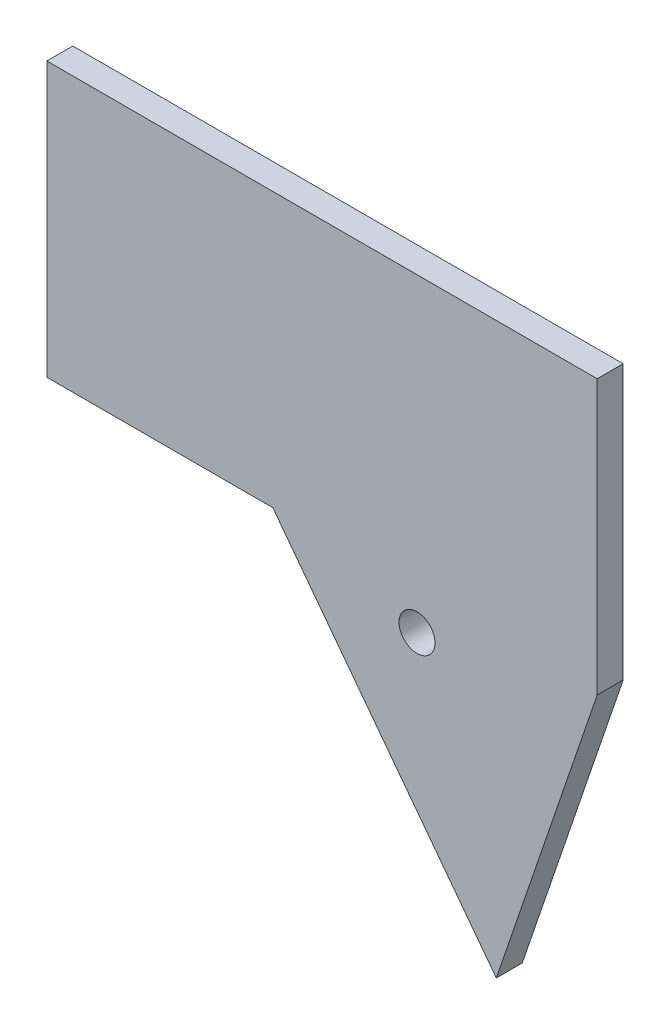
ISO-10303-21;
HEADER;
FILE_DESCRIPTION(('STEP AP214'),'2;1');
FILE_NAME('part.step','',(''),(''),'','','');
FILE_SCHEMA(('AUTOMOTIVE_DESIGN { 1 0 10303 214 1 1 1 1 }'));
ENDSEC;
DATA;
#1=APPLICATION_CONTEXT('core data for automotive mechanical design processes');
#2=APPLICATION_PROTOCOL_DEFINITION('international standard','automotive_design',2000,#1);
#3=PRODUCT_CONTEXT('',#1,'mechanical');
#4=PRODUCT('Part','Part','',(#3));
#5=PRODUCT_RELATED_PRODUCT_CATEGORY('part','',(#4));
#6=PRODUCT_DEFINITION_FORMATION('','',#4);
#7=PRODUCT_DEFINITION_CONTEXT('part definition',#1,'design');
#8=PRODUCT_DEFINITION('design','',#6,#7);
#9=PRODUCT_DEFINITION_SHAPE('','',#8);
#10=(LENGTH_UNIT() NAMED_UNIT(*) SI_UNIT(.MILLI.,.METRE.));
#11=(NAMED_UNIT(*) PLANE_ANGLE_UNIT() SI_UNIT($,.RADIAN.));
#12=(NAMED_UNIT(*) SI_UNIT($,.STERADIAN.) SOLID_ANGLE_UNIT());
#13=UNCERTAINTY_MEASURE_WITH_UNIT(LENGTH_MEASURE(1.E-05),#10,'distance_accuracy_value','');
#14=(GEOMETRIC_REPRESENTATION_CONTEXT(3) GLOBAL_UNCERTAINTY_ASSIGNED_CONTEXT((#13)) GLOBAL_UNIT_ASSIGNED_CONTEXT((#10,
#11,#12)) REPRESENTATION_CONTEXT('',''));
#15=CARTESIAN_POINT('',(0.,0.,0.));
#16=DIRECTION('',(0.,0.,1.));
#17=DIRECTION('',(1.,0.,0.));
#18=AXIS2_PLACEMENT_3D('',#15,#16,#17);
#19=CARTESIAN_POINT('',(-16.,-19.,3.));
#20=DIRECTION('',(0.,1.,0.));
#21=DIRECTION('',(0.,0.,1.));
#22=AXIS2_PLACEMENT_3D('',#19,#20,#21);
#23=PLANE('',#22);
#24=DIRECTION('',(0.,0.,-1.));
#25=VECTOR('',#24,1.);
#26=CARTESIAN_POINT('',(15.3546368688924,-19.,64.4769250208977));
#27=LINE('',#26,#25);
#28=CARTESIAN_POINT('',(15.3546368688924,-19.,3.6));
#29=VERTEX_POINT('',#28);
#30=CARTESIAN_POINT('',(15.3546368688924,-19.,0.));
#31=VERTEX_POINT('',#30);
#32=EDGE_CURVE('E59',#29,#31,#27,.T.);
#33=ORIENTED_EDGE('',*,*,#32,.F.);
#34=DIRECTION('',(-1.,0.,0.));
#35=VECTOR('',#34,1.);
#36=CARTESIAN_POINT('',(60.3546368688924,-19.,3.6));
#37=LINE('',#36,#35);
#38=CARTESIAN_POINT('',(-16.,-19.,3.6));
#39=VERTEX_POINT('',#38);
#40=EDGE_CURVE('E139',#29,#39,#37,.T.);
#41=ORIENTED_EDGE('',*,*,#40,.T.);
#42=DIRECTION('',(0.,0.,-1.));
#43=VECTOR('',#42,1.);
#44=CARTESIAN_POINT('',(-16.,-19.,3.));
#45=LINE('',#44,#43);
#46=CARTESIAN_POINT('',(-16.,-19.,0.));
#47=VERTEX_POINT('',#46);
#48=EDGE_CURVE('E11',#39,#47,#45,.T.);
#49=ORIENTED_EDGE('',*,*,#48,.T.);
#50=DIRECTION('',(1.,0.,0.));
#51=VECTOR('',#50,1.);
#52=CARTESIAN_POINT('',(-16.,-19.,0.));
#53=LINE('',#52,#51);
#54=EDGE_CURVE('E168',#47,#31,#53,.T.);
#55=ORIENTED_EDGE('',*,*,#54,.T.);
#56=EDGE_LOOP('',(#33,#41,#49,#55));
#57=FACE_BOUND('',#56,.T.);
#58=ADVANCED_FACE('F43',(#57),#23,.F.);
#59=CARTESIAN_POINT('',(0.,0.,0.));
#60=DIRECTION('',(0.,0.,1.));
#61=DIRECTION('',(1.,0.,0.));
#62=AXIS2_PLACEMENT_3D('',#59,#60,#61);
#63=PLANE('',#62);
#64=DIRECTION('',(0.,-1.,0.));
#65=VECTOR('',#64,1.);
#66=CARTESIAN_POINT('',(-16.,19.,0.));
#67=LINE('',#66,#65);
#68=CARTESIAN_POINT('',(-16.,19.,0.));
#69=VERTEX_POINT('',#68);
#70=EDGE_CURVE('E164',#69,#47,#67,.T.);
#71=ORIENTED_EDGE('',*,*,#70,.F.);
#72=DIRECTION('',(-1.,0.,0.));
#73=VECTOR('',#72,1.);
#74=CARTESIAN_POINT('',(-16.,19.,0.));
#75=LINE('',#74,#73);
#76=CARTESIAN_POINT('',(60.3546368688924,19.,0.));
#77=VERTEX_POINT('',#76);
#78=EDGE_CURVE('E67',#77,#69,#75,.T.);
#79=ORIENTED_EDGE('',*,*,#78,.F.);
#80=DIRECTION('',(0.,1.,0.));
#81=VECTOR('',#80,1.);
#82=CARTESIAN_POINT('',(60.3546368688924,19.,0.));
#83=LINE('',#82,#81);
#84=CARTESIAN_POINT('',(60.3546368688924,-19.,0.));
#85=VERTEX_POINT('',#84);
#86=EDGE_CURVE('E118',#85,#77,#83,.T.);
#87=ORIENTED_EDGE('',*,*,#86,.F.);
#88=DIRECTION('',(-0.32314385329151,-0.946349856067995,0.));
#89=VECTOR('',#88,1.);
#90=CARTESIAN_POINT('',(46.3546368688924,-60.,0.));
#91=LINE('',#90,#89);
#92=CARTESIAN_POINT('',(46.3546368688924,-60.,0.));
#93=VERTEX_POINT('',#92);
#94=EDGE_CURVE('E103',#85,#93,#91,.T.);
#95=ORIENTED_EDGE('',*,*,#94,.T.);
#96=DIRECTION('',(-0.603108274871746,0.797659331281987,0.));
#97=VECTOR('',#96,1.);
#98=CARTESIAN_POINT('',(15.3546368688924,-19.,0.));
#99=LINE('',#98,#97);
#100=EDGE_CURVE('E110',#93,#31,#99,.T.);
#101=ORIENTED_EDGE('',*,*,#100,.T.);
#102=ORIENTED_EDGE('',*,*,#54,.F.);
#103=EDGE_LOOP('',(#71,#79,#87,#95,#101,#102));
#104=FACE_BOUND('',#103,.T.);
#105=CARTESIAN_POINT('',(0.,0.,0.));
#106=DIRECTION('',(0.,0.,1.));
#107=DIRECTION('',(1.,0.,0.));
#108=AXIS2_PLACEMENT_3D('',#105,#106,#107);
#109=CIRCLE('',#108,4.55);
#110=CARTESIAN_POINT('',(4.55,0.,0.));
#111=VERTEX_POINT('',#110);
#112=EDGE_CURVE('E160',#111,#111,#109,.T.);
#113=ORIENTED_EDGE('',*,*,#112,.T.);
#114=EDGE_LOOP('',(#113));
#115=FACE_BOUND('',#114,.T.);
#116=CARTESIAN_POINT('',(35.3546368688924,-24.,0.));
#117=DIRECTION('',(0.,0.,-1.));
#118=DIRECTION('',(-1.,0.,0.));
#119=AXIS2_PLACEMENT_3D('',#116,#117,#118);
#120=CIRCLE('',#119,2.49999999999999);
#121=CARTESIAN_POINT('',(32.8546368688924,-24.,0.));
#122=VERTEX_POINT('',#121);
#123=EDGE_CURVE('E120',#122,#122,#120,.T.);
#124=ORIENTED_EDGE('',*,*,#123,.F.);
#125=EDGE_LOOP('',(#124));
#126=FACE_BOUND('',#125,.T.);
#127=ADVANCED_FACE('F116',(#104,#115,#126),#63,.F.);
#128=CARTESIAN_POINT('',(-16.,19.,3.));
#129=DIRECTION('',(1.,0.,0.));
#130=DIRECTION('',(0.,0.,-1.));
#131=AXIS2_PLACEMENT_3D('',#128,#129,#130);
#132=PLANE('',#131);
#133=ORIENTED_EDGE('',*,*,#70,.T.);
#134=ORIENTED_EDGE('',*,*,#48,.F.);
#135=DIRECTION('',(0.,1.,0.));
#136=VECTOR('',#135,1.);
#137=CARTESIAN_POINT('',(-16.,-19.,3.6));
#138=LINE('',#137,#136);
#139=CARTESIAN_POINT('',(-16.,19.,3.6));
#140=VERTEX_POINT('',#139);
#141=EDGE_CURVE('E145',#39,#140,#138,.T.);
#142=ORIENTED_EDGE('',*,*,#141,.T.);
#143=DIRECTION('',(0.,0.,-1.));
#144=VECTOR('',#143,1.);
#145=CARTESIAN_POINT('',(-16.,19.,3.));
#146=LINE('',#145,#144);
#147=EDGE_CURVE('E175',#140,#69,#146,.T.);
#148=ORIENTED_EDGE('',*,*,#147,.T.);
#149=EDGE_LOOP('',(#133,#134,#142,#148));
#150=FACE_BOUND('',#149,.T.);
#151=ADVANCED_FACE('F45',(#150),#132,.F.);
#152=CARTESIAN_POINT('',(60.3546368688924,19.,3.));
#153=DIRECTION('',(-1.,0.,0.));
#154=DIRECTION('',(0.,0.,1.));
#155=AXIS2_PLACEMENT_3D('',#152,#153,#154);
#156=PLANE('',#155);
#157=ORIENTED_EDGE('',*,*,#86,.T.);
#158=DIRECTION('',(0.,0.,-1.));
#159=VECTOR('',#158,1.);
#160=CARTESIAN_POINT('',(60.3546368688924,19.,3.));
#161=LINE('',#160,#159);
#162=CARTESIAN_POINT('',(60.3546368688924,19.,3.6));
#163=VERTEX_POINT('',#162);
#164=EDGE_CURVE('E178',#163,#77,#161,.T.);
#165=ORIENTED_EDGE('',*,*,#164,.F.);
#166=DIRECTION('',(0.,-1.,0.));
#167=VECTOR('',#166,1.);
#168=CARTESIAN_POINT('',(60.3546368688924,19.,3.6));
#169=LINE('',#168,#167);
#170=CARTESIAN_POINT('',(60.3546368688924,-19.,3.6));
#171=VERTEX_POINT('',#170);
#172=EDGE_CURVE('E153',#163,#171,#169,.T.);
#173=ORIENTED_EDGE('',*,*,#172,.T.);
#174=DIRECTION('',(0.,0.,-1.));
#175=VECTOR('',#174,1.);
#176=CARTESIAN_POINT('',(60.3546368688924,-19.,3.));
#177=LINE('',#176,#175);
#178=EDGE_CURVE('E52',#171,#85,#177,.T.);
#179=ORIENTED_EDGE('',*,*,#178,.T.);
#180=EDGE_LOOP('',(#157,#165,#173,#179));
#181=FACE_BOUND('',#180,.T.);
#182=ADVANCED_FACE('F182',(#181),#156,.F.);
#183=CARTESIAN_POINT('',(-16.,19.,3.));
#184=DIRECTION('',(0.,-1.,0.));
#185=DIRECTION('',(0.,0.,-1.));
#186=AXIS2_PLACEMENT_3D('',#183,#184,#185);
#187=PLANE('',#186);
#188=ORIENTED_EDGE('',*,*,#78,.T.);
#189=ORIENTED_EDGE('',*,*,#147,.F.);
#190=DIRECTION('',(1.,0.,0.));
#191=VECTOR('',#190,1.);
#192=CARTESIAN_POINT('',(-16.,19.,3.6));
#193=LINE('',#192,#191);
#194=EDGE_CURVE('E149',#140,#163,#193,.T.);
#195=ORIENTED_EDGE('',*,*,#194,.T.);
#196=ORIENTED_EDGE('',*,*,#164,.T.);
#197=EDGE_LOOP('',(#188,#189,#195,#196));
#198=FACE_BOUND('',#197,.T.);
#199=ADVANCED_FACE('F209',(#198),#187,.F.);
#200=CARTESIAN_POINT('',(0.,0.,3.));
#201=DIRECTION('',(0.,0.,-1.));
#202=DIRECTION('',(-1.,0.,0.));
#203=AXIS2_PLACEMENT_3D('',#200,#201,#202);
#204=CYLINDRICAL_SURFACE('',#203,4.55);
#205=CARTESIAN_POINT('',(0.,0.,3.));
#206=DIRECTION('',(0.,0.,1.));
#207=DIRECTION('',(1.,0.,0.));
#208=AXIS2_PLACEMENT_3D('',#205,#206,#207);
#209=CIRCLE('',#208,4.55);
#210=CARTESIAN_POINT('',(4.55,0.,3.));
#211=VERTEX_POINT('',#210);
#212=EDGE_CURVE('E156',#211,#211,#209,.T.);
#213=ORIENTED_EDGE('',*,*,#212,.T.);
#214=EDGE_LOOP('',(#213));
#215=FACE_BOUND('',#214,.T.);
#216=ORIENTED_EDGE('',*,*,#112,.F.);
#217=EDGE_LOOP('',(#216));
#218=FACE_BOUND('',#217,.T.);
#219=ADVANCED_FACE('F207',(#215,#218),#204,.F.);
#220=CARTESIAN_POINT('',(0.,0.,3.));
#221=DIRECTION('',(0.,0.,-1.));
#222=DIRECTION('',(-1.,0.,0.));
#223=AXIS2_PLACEMENT_3D('',#220,#221,#222);
#224=PLANE('',#223);
#225=CARTESIAN_POINT('',(0.,0.,3.));
#226=DIRECTION('',(0.,0.,-1.));
#227=DIRECTION('',(-1.,0.,0.));
#228=AXIS2_PLACEMENT_3D('',#225,#226,#227);
#229=CIRCLE('',#228,3.5);
#230=CARTESIAN_POINT('',(-3.5,0.,3.));
#231=VERTEX_POINT('',#230);
#232=EDGE_CURVE('E134',#231,#231,#229,.T.);
#233=ORIENTED_EDGE('',*,*,#232,.F.);
#234=EDGE_LOOP('',(#233));
#235=FACE_BOUND('',#234,.T.);
#236=ORIENTED_EDGE('',*,*,#212,.F.);
#237=EDGE_LOOP('',(#236));
#238=FACE_BOUND('',#237,.T.);
#239=ADVANCED_FACE('F229',(#235,#238),#224,.T.);
#240=CARTESIAN_POINT('',(0.,0.,3.6));
#241=DIRECTION('',(0.,0.,-1.));
#242=DIRECTION('',(-1.,0.,0.));
#243=AXIS2_PLACEMENT_3D('',#240,#241,#242);
#244=PLANE('',#243);
#245=ORIENTED_EDGE('',*,*,#40,.F.);
#246=DIRECTION('',(0.603108274871746,-0.797659331281987,0.));
#247=VECTOR('',#246,1.);
#248=CARTESIAN_POINT('',(15.3546368688924,-19.,3.6));
#249=LINE('',#248,#247);
#250=CARTESIAN_POINT('',(46.3546368688924,-60.,3.6));
#251=VERTEX_POINT('',#250);
#252=EDGE_CURVE('E128',#29,#251,#249,.T.);
#253=ORIENTED_EDGE('',*,*,#252,.T.);
#254=DIRECTION('',(0.32314385329151,0.946349856067995,0.));
#255=VECTOR('',#254,1.);
#256=CARTESIAN_POINT('',(46.3546368688924,-60.,3.6));
#257=LINE('',#256,#255);
#258=EDGE_CURVE('E105',#251,#171,#257,.T.);
#259=ORIENTED_EDGE('',*,*,#258,.T.);
#260=ORIENTED_EDGE('',*,*,#172,.F.);
#261=ORIENTED_EDGE('',*,*,#194,.F.);
#262=ORIENTED_EDGE('',*,*,#141,.F.);
#263=EDGE_LOOP('',(#245,#253,#259,#260,#261,#262));
#264=FACE_BOUND('',#263,.T.);
#265=CARTESIAN_POINT('',(35.3546368688924,-24.,3.6));
#266=DIRECTION('',(0.,0.,-1.));
#267=DIRECTION('',(-1.,0.,0.));
#268=AXIS2_PLACEMENT_3D('',#265,#266,#267);
#269=CIRCLE('',#268,2.49999999999999);
#270=CARTESIAN_POINT('',(32.8546368688924,-24.,3.6));
#271=VERTEX_POINT('',#270);
#272=EDGE_CURVE('E130',#271,#271,#269,.F.);
#273=ORIENTED_EDGE('',*,*,#272,.F.);
#274=EDGE_LOOP('',(#273));
#275=FACE_BOUND('',#274,.T.);
#276=ADVANCED_FACE('F186',(#264,#275),#244,.F.);
#277=CARTESIAN_POINT('',(0.,0.,3.4));
#278=DIRECTION('',(0.,0.,-1.));
#279=DIRECTION('',(-1.,0.,0.));
#280=AXIS2_PLACEMENT_3D('',#277,#278,#279);
#281=CYLINDRICAL_SURFACE('',#280,3.5);
#282=CARTESIAN_POINT('',(0.,0.,3.4));
#283=DIRECTION('',(0.,0.,-1.));
#284=DIRECTION('',(-1.,0.,0.));
#285=AXIS2_PLACEMENT_3D('',#282,#283,#284);
#286=CIRCLE('',#285,3.5);
#287=CARTESIAN_POINT('',(-3.5,0.,3.4));
#288=VERTEX_POINT('',#287);
#289=EDGE_CURVE('E135',#288,#288,#286,.T.);
#290=ORIENTED_EDGE('',*,*,#289,.F.);
#291=EDGE_LOOP('',(#290));
#292=FACE_BOUND('',#291,.T.);
#293=ORIENTED_EDGE('',*,*,#232,.T.);
#294=EDGE_LOOP('',(#293));
#295=FACE_BOUND('',#294,.T.);
#296=ADVANCED_FACE('F241',(#292,#295),#281,.F.);
#297=CARTESIAN_POINT('',(0.,0.,3.4));
#298=DIRECTION('',(0.,0.,-1.));
#299=DIRECTION('',(-1.,0.,0.));
#300=AXIS2_PLACEMENT_3D('',#297,#298,#299);
#301=PLANE('',#300);
#302=ORIENTED_EDGE('',*,*,#289,.T.);
#303=EDGE_LOOP('',(#302));
#304=FACE_BOUND('',#303,.T.);
#305=ADVANCED_FACE('F248',(#304),#301,.T.);
#306=CARTESIAN_POINT('',(46.3546368688924,-60.,64.4769250208977));
#307=DIRECTION('',(0.946349856067995,-0.32314385329151,0.));
#308=DIRECTION('',(0.32314385329151,0.946349856067995,0.));
#309=AXIS2_PLACEMENT_3D('',#306,#307,#308);
#310=PLANE('',#309);
#311=ORIENTED_EDGE('',*,*,#258,.F.);
#312=DIRECTION('',(0.,0.,-1.));
#313=VECTOR('',#312,1.);
#314=CARTESIAN_POINT('',(46.3546368688924,-60.,64.4769250208977));
#315=LINE('',#314,#313);
#316=EDGE_CURVE('E99',#251,#93,#315,.T.);
#317=ORIENTED_EDGE('',*,*,#316,.T.);
#318=ORIENTED_EDGE('',*,*,#94,.F.);
#319=ORIENTED_EDGE('',*,*,#178,.F.);
#320=EDGE_LOOP('',(#311,#317,#318,#319));
#321=FACE_BOUND('',#320,.T.);
#322=ADVANCED_FACE('F101',(#321),#310,.T.);
#323=CARTESIAN_POINT('',(15.3546368688924,-19.,64.4769250208977));
#324=DIRECTION('',(-0.797659331281987,-0.603108274871746,0.));
#325=DIRECTION('',(0.603108274871746,-0.797659331281987,0.));
#326=AXIS2_PLACEMENT_3D('',#323,#324,#325);
#327=PLANE('',#326);
#328=ORIENTED_EDGE('',*,*,#252,.F.);
#329=ORIENTED_EDGE('',*,*,#32,.T.);
#330=ORIENTED_EDGE('',*,*,#100,.F.);
#331=ORIENTED_EDGE('',*,*,#316,.F.);
#332=EDGE_LOOP('',(#328,#329,#330,#331));
#333=FACE_BOUND('',#332,.T.);
#334=ADVANCED_FACE('F122',(#333),#327,.T.);
#335=CARTESIAN_POINT('',(35.3546368688924,-24.,64.4769250208977));
#336=DIRECTION('',(0.,0.,-1.));
#337=DIRECTION('',(-1.,0.,0.));
#338=AXIS2_PLACEMENT_3D('',#335,#336,#337);
#339=CYLINDRICAL_SURFACE('',#338,2.49999999999999);
#340=ORIENTED_EDGE('',*,*,#272,.T.);
#341=EDGE_LOOP('',(#340));
#342=FACE_BOUND('',#341,.T.);
#343=ORIENTED_EDGE('',*,*,#123,.T.);
#344=EDGE_LOOP('',(#343));
#345=FACE_BOUND('',#344,.T.);
#346=ADVANCED_FACE('F196',(#342,#345),#339,.F.);
#347=CLOSED_SHELL('',(#58,#127,#151,#182,#199,#219,#239,#276,#296,#305,#322,#334,#346));
#348=MANIFOLD_SOLID_BREP('B2',#347);
#349=ADVANCED_BREP_SHAPE_REPRESENTATION('',(#18,#348),#14);
#350=SHAPE_DEFINITION_REPRESENTATION(#9,#349);
ENDSEC;
END-ISO-10303-21;
